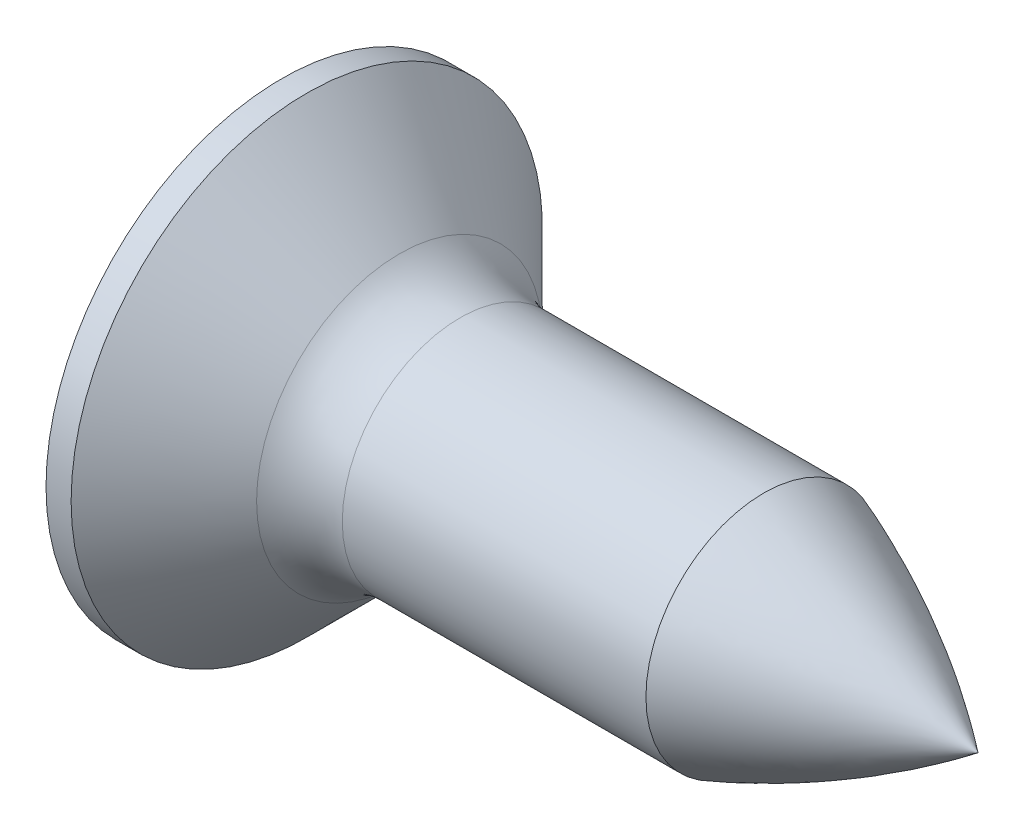
ISO-10303-21;
HEADER;
FILE_DESCRIPTION(('STEP AP214'),'2;1');
FILE_NAME('part.step','',(''),(''),'','','');
FILE_SCHEMA(('AUTOMOTIVE_DESIGN { 1 0 10303 214 1 1 1 1 }'));
ENDSEC;
DATA;
#1=APPLICATION_CONTEXT('core data for automotive mechanical design processes');
#2=APPLICATION_PROTOCOL_DEFINITION('international standard','automotive_design',2000,#1);
#3=PRODUCT_CONTEXT('',#1,'mechanical');
#4=PRODUCT('Part','Part','',(#3));
#5=PRODUCT_RELATED_PRODUCT_CATEGORY('part','',(#4));
#6=PRODUCT_DEFINITION_FORMATION('','',#4);
#7=PRODUCT_DEFINITION_CONTEXT('part definition',#1,'design');
#8=PRODUCT_DEFINITION('design','',#6,#7);
#9=PRODUCT_DEFINITION_SHAPE('','',#8);
#10=(LENGTH_UNIT() NAMED_UNIT(*) SI_UNIT(.MILLI.,.METRE.));
#11=(NAMED_UNIT(*) PLANE_ANGLE_UNIT() SI_UNIT($,.RADIAN.));
#12=(NAMED_UNIT(*) SI_UNIT($,.STERADIAN.) SOLID_ANGLE_UNIT());
#13=UNCERTAINTY_MEASURE_WITH_UNIT(LENGTH_MEASURE(1.E-05),#10,'distance_accuracy_value','');
#14=(GEOMETRIC_REPRESENTATION_CONTEXT(3) GLOBAL_UNCERTAINTY_ASSIGNED_CONTEXT((#13)) GLOBAL_UNIT_ASSIGNED_CONTEXT((#10,
#11,#12)) REPRESENTATION_CONTEXT('',''));
#15=CARTESIAN_POINT('',(0.,0.,0.));
#16=DIRECTION('',(0.,0.,1.));
#17=DIRECTION('',(1.,0.,0.));
#18=AXIS2_PLACEMENT_3D('',#15,#16,#17);
#19=CARTESIAN_POINT('',(-20.4182283145145,0.,0.));
#20=DIRECTION('',(-1.,0.,0.));
#21=DIRECTION('',(0.,0.,1.));
#22=AXIS2_PLACEMENT_3D('',#19,#20,#21);
#23=CYLINDRICAL_SURFACE('',#22,1.09999999999999);
#24=CARTESIAN_POINT('',(2.16568542494922,0.,0.));
#25=DIRECTION('',(-1.,0.,0.));
#26=DIRECTION('',(0.,0.,1.));
#27=AXIS2_PLACEMENT_3D('',#24,#25,#26);
#28=CIRCLE('',#27,1.09999999999999);
#29=CARTESIAN_POINT('',(2.16568542494922,0.,1.09999999999999));
#30=VERTEX_POINT('',#29);
#31=EDGE_CURVE('E171',#30,#30,#28,.T.);
#32=ORIENTED_EDGE('',*,*,#31,.F.);
#33=EDGE_LOOP('',(#32));
#34=FACE_BOUND('',#33,.T.);
#35=CARTESIAN_POINT('',(5.,0.,0.));
#36=DIRECTION('',(1.,0.,0.));
#37=DIRECTION('',(0.,1.,0.));
#38=AXIS2_PLACEMENT_3D('',#35,#36,#37);
#39=CIRCLE('',#38,1.1);
#40=CARTESIAN_POINT('',(5.,1.1,0.));
#41=VERTEX_POINT('',#40);
#42=EDGE_CURVE('E251',#41,#41,#39,.T.);
#43=ORIENTED_EDGE('',*,*,#42,.F.);
#44=EDGE_LOOP('',(#43));
#45=FACE_BOUND('',#44,.T.);
#46=ADVANCED_FACE('F38',(#34,#45),#23,.T.);
#47=CARTESIAN_POINT('',(5.09,0.,0.));
#48=DIRECTION('',(-1.,0.,0.));
#49=DIRECTION('',(0.,1.,0.));
#50=AXIS2_PLACEMENT_3D('',#47,#48,#49);
#51=SPHERICAL_SURFACE('',#50,5.09);
#52=CARTESIAN_POINT('',(0.5,0.,0.));
#53=DIRECTION('',(-1.,0.,0.));
#54=DIRECTION('',(0.,0.,1.));
#55=AXIS2_PLACEMENT_3D('',#52,#53,#54);
#56=CIRCLE('',#55,2.19999999999999);
#57=CARTESIAN_POINT('',(0.5,0.,2.19999999999999));
#58=VERTEX_POINT('',#57);
#59=EDGE_CURVE('E228',#58,#58,#56,.T.);
#60=ORIENTED_EDGE('',*,*,#59,.T.);
#61=EDGE_LOOP('',(#60));
#62=FACE_BOUND('',#61,.T.);
#63=CARTESIAN_POINT('',(5.09,0.,-0.220000000000001));
#64=DIRECTION('',(0.,0.,1.));
#65=DIRECTION('',(1.,0.,0.));
#66=AXIS2_PLACEMENT_3D('',#63,#64,#65);
#67=CIRCLE('',#66,5.08524335700859);
#68=CARTESIAN_POINT('',(0.111345989317939,1.0357143630941,-0.220000000000001));
#69=VERTEX_POINT('',#68);
#70=CARTESIAN_POINT('',(0.00951773942669838,0.219999999999999,-0.220000000000001));
#71=VERTEX_POINT('',#70);
#72=EDGE_CURVE('E11',#69,#71,#67,.T.);
#73=ORIENTED_EDGE('',*,*,#72,.F.);
#74=CARTESIAN_POINT('',(4.29381397208144,-1.3790346526314,0.));
#75=DIRECTION('',(-0.500000000000001,-0.866025403784438,0.));
#76=DIRECTION('',(0.866025403784438,-0.500000000000001,0.));
#77=AXIS2_PLACEMENT_3D('',#74,#75,#76);
#78=CIRCLE('',#77,4.83450630734815);
#79=CARTESIAN_POINT('',(0.111345989317939,1.0357143630941,0.219999999999999));
#80=VERTEX_POINT('',#79);
#81=EDGE_CURVE('E48',#80,#69,#78,.T.);
#82=ORIENTED_EDGE('',*,*,#81,.F.);
#83=CARTESIAN_POINT('',(5.09,0.,0.219999999999999));
#84=DIRECTION('',(0.,0.,-1.));
#85=DIRECTION('',(0.,1.,0.));
#86=AXIS2_PLACEMENT_3D('',#83,#84,#85);
#87=CIRCLE('',#86,5.08524335700859);
#88=CARTESIAN_POINT('',(0.00951773942669838,0.219999999999999,0.219999999999999));
#89=VERTEX_POINT('',#88);
#90=EDGE_CURVE('E167',#89,#80,#87,.T.);
#91=ORIENTED_EDGE('',*,*,#90,.F.);
#92=CARTESIAN_POINT('',(5.09,0.219999999999999,0.));
#93=DIRECTION('',(0.,-1.,0.));
#94=DIRECTION('',(0.,0.,-1.));
#95=AXIS2_PLACEMENT_3D('',#92,#93,#94);
#96=CIRCLE('',#95,5.08524335700859);
#97=CARTESIAN_POINT('',(0.111345989317938,0.219999999999999,1.0357143630941));
#98=VERTEX_POINT('',#97);
#99=EDGE_CURVE('E161',#98,#89,#96,.T.);
#100=ORIENTED_EDGE('',*,*,#99,.F.);
#101=CARTESIAN_POINT('',(4.29381397208144,0.,-1.3790346526314));
#102=DIRECTION('',(-0.500000000000001,0.,-0.866025403784438));
#103=DIRECTION('',(-0.866025403784438,0.,0.500000000000001));
#104=AXIS2_PLACEMENT_3D('',#101,#102,#103);
#105=CIRCLE('',#104,4.83450630734815);
#106=CARTESIAN_POINT('',(0.111345989317938,-0.220000000000001,1.0357143630941));
#107=VERTEX_POINT('',#106);
#108=EDGE_CURVE('E159',#107,#98,#105,.T.);
#109=ORIENTED_EDGE('',*,*,#108,.F.);
#110=CARTESIAN_POINT('',(5.09,-0.220000000000001,0.));
#111=DIRECTION('',(0.,1.,0.));
#112=DIRECTION('',(0.,0.,1.));
#113=AXIS2_PLACEMENT_3D('',#110,#111,#112);
#114=CIRCLE('',#113,5.08524335700859);
#115=CARTESIAN_POINT('',(0.00951773942669838,-0.220000000000001,0.219999999999999));
#116=VERTEX_POINT('',#115);
#117=EDGE_CURVE('E143',#116,#107,#114,.T.);
#118=ORIENTED_EDGE('',*,*,#117,.F.);
#119=CARTESIAN_POINT('',(5.09,0.,0.219999999999999));
#120=DIRECTION('',(0.,0.,-1.));
#121=DIRECTION('',(-1.,0.,0.));
#122=AXIS2_PLACEMENT_3D('',#119,#120,#121);
#123=CIRCLE('',#122,5.08524335700859);
#124=CARTESIAN_POINT('',(0.111345989317937,-1.0357143630941,0.219999999999999));
#125=VERTEX_POINT('',#124);
#126=EDGE_CURVE('E133',#125,#116,#123,.T.);
#127=ORIENTED_EDGE('',*,*,#126,.F.);
#128=CARTESIAN_POINT('',(4.29381397208144,1.3790346526314,0.));
#129=DIRECTION('',(-0.500000000000001,0.866025403784438,0.));
#130=DIRECTION('',(-0.866025403784438,-0.500000000000001,0.));
#131=AXIS2_PLACEMENT_3D('',#128,#129,#130);
#132=CIRCLE('',#131,4.83450630734815);
#133=CARTESIAN_POINT('',(0.111345989317937,-1.0357143630941,-0.220000000000001));
#134=VERTEX_POINT('',#133);
#135=EDGE_CURVE('E144',#134,#125,#132,.T.);
#136=ORIENTED_EDGE('',*,*,#135,.F.);
#137=CARTESIAN_POINT('',(5.09,0.,-0.220000000000001));
#138=DIRECTION('',(0.,0.,1.));
#139=DIRECTION('',(0.,-1.,0.));
#140=AXIS2_PLACEMENT_3D('',#137,#138,#139);
#141=CIRCLE('',#140,5.08524335700859);
#142=CARTESIAN_POINT('',(0.00951773942669838,-0.220000000000001,-0.220000000000001));
#143=VERTEX_POINT('',#142);
#144=EDGE_CURVE('E174',#143,#134,#141,.T.);
#145=ORIENTED_EDGE('',*,*,#144,.F.);
#146=CARTESIAN_POINT('',(5.09,-0.220000000000001,0.));
#147=DIRECTION('',(0.,1.,0.));
#148=DIRECTION('',(0.,0.,1.));
#149=AXIS2_PLACEMENT_3D('',#146,#147,#148);
#150=CIRCLE('',#149,5.08524335700859);
#151=CARTESIAN_POINT('',(0.111345989317939,-0.220000000000001,-1.0357143630941));
#152=VERTEX_POINT('',#151);
#153=EDGE_CURVE('E172',#152,#143,#150,.T.);
#154=ORIENTED_EDGE('',*,*,#153,.F.);
#155=CARTESIAN_POINT('',(4.29381397208144,0.,1.3790346526314));
#156=DIRECTION('',(-0.500000000000001,0.,0.866025403784438));
#157=DIRECTION('',(0.866025403784438,0.,0.500000000000001));
#158=AXIS2_PLACEMENT_3D('',#155,#156,#157);
#159=CIRCLE('',#158,4.83450630734815);
#160=CARTESIAN_POINT('',(0.111345989317939,0.219999999999999,-1.0357143630941));
#161=VERTEX_POINT('',#160);
#162=EDGE_CURVE('E170',#161,#152,#159,.T.);
#163=ORIENTED_EDGE('',*,*,#162,.F.);
#164=CARTESIAN_POINT('',(5.09,0.219999999999999,0.));
#165=DIRECTION('',(0.,-1.,0.));
#166=DIRECTION('',(0.,0.,-1.));
#167=AXIS2_PLACEMENT_3D('',#164,#165,#166);
#168=CIRCLE('',#167,5.08524335700859);
#169=EDGE_CURVE('E168',#71,#161,#168,.T.);
#170=ORIENTED_EDGE('',*,*,#169,.F.);
#171=EDGE_LOOP('',(#73,#82,#91,#100,#109,#118,#127,#136,#145,#154,#163,#170));
#172=FACE_BOUND('',#171,.T.);
#173=ADVANCED_FACE('F157',(#62,#172),#51,.T.);
#174=CARTESIAN_POINT('',(2.16568542494923,0.,0.));
#175=DIRECTION('',(-1.,0.,0.));
#176=DIRECTION('',(0.,0.,1.));
#177=AXIS2_PLACEMENT_3D('',#174,#175,#176);
#178=TOROIDAL_SURFACE('',#177,1.9,0.800000000000003);
#179=CARTESIAN_POINT('',(1.6,0.,0.));
#180=DIRECTION('',(-1.,0.,0.));
#181=DIRECTION('',(0.,0.,1.));
#182=AXIS2_PLACEMENT_3D('',#179,#180,#181);
#183=CIRCLE('',#182,1.33431457505075);
#184=CARTESIAN_POINT('',(1.6,0.,1.33431457505075));
#185=VERTEX_POINT('',#184);
#186=EDGE_CURVE('E195',#185,#185,#183,.T.);
#187=ORIENTED_EDGE('',*,*,#186,.F.);
#188=EDGE_LOOP('',(#187));
#189=FACE_BOUND('',#188,.T.);
#190=ORIENTED_EDGE('',*,*,#31,.T.);
#191=EDGE_LOOP('',(#190));
#192=FACE_BOUND('',#191,.T.);
#193=ADVANCED_FACE('F283',(#189,#192),#178,.F.);
#194=CARTESIAN_POINT('',(-20.4182283145145,0.,0.));
#195=DIRECTION('',(-1.,0.,0.));
#196=DIRECTION('',(0.,0.,1.));
#197=AXIS2_PLACEMENT_3D('',#194,#195,#196);
#198=CYLINDRICAL_SURFACE('',#197,2.19999999999999);
#199=ORIENTED_EDGE('',*,*,#59,.F.);
#200=EDGE_LOOP('',(#199));
#201=FACE_BOUND('',#200,.T.);
#202=CARTESIAN_POINT('',(0.734314575050726,0.,0.));
#203=DIRECTION('',(-1.,0.,0.));
#204=DIRECTION('',(0.,0.,1.));
#205=AXIS2_PLACEMENT_3D('',#202,#203,#204);
#206=CIRCLE('',#205,2.2);
#207=CARTESIAN_POINT('',(0.734314575050726,0.,2.2));
#208=VERTEX_POINT('',#207);
#209=EDGE_CURVE('E224',#208,#208,#206,.T.);
#210=ORIENTED_EDGE('',*,*,#209,.T.);
#211=EDGE_LOOP('',(#210));
#212=FACE_BOUND('',#211,.T.);
#213=ADVANCED_FACE('F291',(#201,#212),#198,.T.);
#214=CARTESIAN_POINT('',(1.6,0.,0.));
#215=DIRECTION('',(-1.,0.,0.));
#216=DIRECTION('',(0.,0.,1.));
#217=AXIS2_PLACEMENT_3D('',#214,#215,#216);
#218=CONICAL_SURFACE('',#217,1.33431457505075,0.785398163397429);
#219=ORIENTED_EDGE('',*,*,#209,.F.);
#220=EDGE_LOOP('',(#219));
#221=FACE_BOUND('',#220,.T.);
#222=ORIENTED_EDGE('',*,*,#186,.T.);
#223=EDGE_LOOP('',(#222));
#224=FACE_BOUND('',#223,.T.);
#225=ADVANCED_FACE('F359',(#221,#224),#218,.T.);
#226=CARTESIAN_POINT('',(1.2,1.1,-0.220000000000001));
#227=DIRECTION('',(0.,0.,1.));
#228=DIRECTION('',(1.,0.,0.));
#229=AXIS2_PLACEMENT_3D('',#226,#227,#228);
#230=PLANE('',#229);
#231=ORIENTED_EDGE('',*,*,#72,.T.);
#232=DIRECTION('',(-1.,0.,0.));
#233=VECTOR('',#232,1.);
#234=CARTESIAN_POINT('',(1.2,0.219999999999999,-0.220000000000001));
#235=LINE('',#234,#233);
#236=CARTESIAN_POINT('',(1.2,0.219999999999999,-0.220000000000001));
#237=VERTEX_POINT('',#236);
#238=EDGE_CURVE('E57',#237,#71,#235,.T.);
#239=ORIENTED_EDGE('',*,*,#238,.F.);
#240=DIRECTION('',(0.,1.,0.));
#241=VECTOR('',#240,1.);
#242=CARTESIAN_POINT('',(1.2,1.1,-0.220000000000001));
#243=LINE('',#242,#241);
#244=CARTESIAN_POINT('',(1.2,0.407179676972447,-0.220000000000001));
#245=VERTEX_POINT('',#244);
#246=EDGE_CURVE('E193',#237,#245,#243,.T.);
#247=ORIENTED_EDGE('',*,*,#246,.T.);
#248=DIRECTION('',(-0.866025403784438,0.500000000000001,0.));
#249=VECTOR('',#248,1.);
#250=CARTESIAN_POINT('',(0.,1.1,-0.220000000000001));
#251=LINE('',#250,#249);
#252=EDGE_CURVE('E188',#245,#69,#251,.T.);
#253=ORIENTED_EDGE('',*,*,#252,.T.);
#254=EDGE_LOOP('',(#231,#239,#247,#253));
#255=FACE_BOUND('',#254,.T.);
#256=ADVANCED_FACE('F246',(#255),#230,.T.);
#257=CARTESIAN_POINT('',(0.,1.1,0.));
#258=DIRECTION('',(-0.500000000000001,-0.866025403784438,0.));
#259=DIRECTION('',(0.866025403784438,-0.500000000000001,0.));
#260=AXIS2_PLACEMENT_3D('',#257,#258,#259);
#261=PLANE('',#260);
#262=ORIENTED_EDGE('',*,*,#81,.T.);
#263=ORIENTED_EDGE('',*,*,#252,.F.);
#264=DIRECTION('',(0.,0.,1.));
#265=VECTOR('',#264,1.);
#266=CARTESIAN_POINT('',(1.2,0.407179676972447,0.));
#267=LINE('',#266,#265);
#268=CARTESIAN_POINT('',(1.2,0.407179676972447,0.219999999999999));
#269=VERTEX_POINT('',#268);
#270=EDGE_CURVE('E190',#245,#269,#267,.T.);
#271=ORIENTED_EDGE('',*,*,#270,.T.);
#272=DIRECTION('',(-0.866025403784438,0.500000000000001,0.));
#273=VECTOR('',#272,1.);
#274=CARTESIAN_POINT('',(0.899999999999999,0.580384757729336,0.219999999999999));
#275=LINE('',#274,#273);
#276=EDGE_CURVE('E185',#269,#80,#275,.T.);
#277=ORIENTED_EDGE('',*,*,#276,.T.);
#278=EDGE_LOOP('',(#262,#263,#271,#277));
#279=FACE_BOUND('',#278,.T.);
#280=ADVANCED_FACE('F40',(#279),#261,.T.);
#281=CARTESIAN_POINT('',(1.2,1.1,0.219999999999999));
#282=DIRECTION('',(0.,0.,-1.));
#283=DIRECTION('',(0.,1.,0.));
#284=AXIS2_PLACEMENT_3D('',#281,#282,#283);
#285=PLANE('',#284);
#286=ORIENTED_EDGE('',*,*,#90,.T.);
#287=ORIENTED_EDGE('',*,*,#276,.F.);
#288=DIRECTION('',(0.,-1.,0.));
#289=VECTOR('',#288,1.);
#290=CARTESIAN_POINT('',(1.2,1.1,0.219999999999999));
#291=LINE('',#290,#289);
#292=CARTESIAN_POINT('',(1.2,0.219999999999999,0.219999999999999));
#293=VERTEX_POINT('',#292);
#294=EDGE_CURVE('E192',#269,#293,#291,.T.);
#295=ORIENTED_EDGE('',*,*,#294,.T.);
#296=DIRECTION('',(-1.,0.,0.));
#297=VECTOR('',#296,1.);
#298=CARTESIAN_POINT('',(1.2,0.219999999999999,0.219999999999999));
#299=LINE('',#298,#297);
#300=EDGE_CURVE('E189',#293,#89,#299,.T.);
#301=ORIENTED_EDGE('',*,*,#300,.T.);
#302=EDGE_LOOP('',(#286,#287,#295,#301));
#303=FACE_BOUND('',#302,.T.);
#304=ADVANCED_FACE('F236',(#303),#285,.T.);
#305=CARTESIAN_POINT('',(1.2,0.219999999999999,0.219999999999999));
#306=DIRECTION('',(0.,-1.,0.));
#307=DIRECTION('',(0.,0.,-1.));
#308=AXIS2_PLACEMENT_3D('',#305,#306,#307);
#309=PLANE('',#308);
#310=ORIENTED_EDGE('',*,*,#99,.T.);
#311=ORIENTED_EDGE('',*,*,#300,.F.);
#312=DIRECTION('',(0.,0.,1.));
#313=VECTOR('',#312,1.);
#314=CARTESIAN_POINT('',(1.2,0.219999999999999,0.219999999999999));
#315=LINE('',#314,#313);
#316=CARTESIAN_POINT('',(1.2,0.219999999999999,0.407179676972447));
#317=VERTEX_POINT('',#316);
#318=EDGE_CURVE('E201',#293,#317,#315,.T.);
#319=ORIENTED_EDGE('',*,*,#318,.T.);
#320=DIRECTION('',(-0.866025403784438,0.,0.500000000000001));
#321=VECTOR('',#320,1.);
#322=CARTESIAN_POINT('',(0.,0.219999999999999,1.1));
#323=LINE('',#322,#321);
#324=EDGE_CURVE('E198',#317,#98,#323,.T.);
#325=ORIENTED_EDGE('',*,*,#324,.T.);
#326=EDGE_LOOP('',(#310,#311,#319,#325));
#327=FACE_BOUND('',#326,.T.);
#328=ADVANCED_FACE('F297',(#327),#309,.T.);
#329=CARTESIAN_POINT('',(0.,0.,1.1));
#330=DIRECTION('',(-0.500000000000001,0.,-0.866025403784438));
#331=DIRECTION('',(-0.866025403784438,0.,0.500000000000001));
#332=AXIS2_PLACEMENT_3D('',#329,#330,#331);
#333=PLANE('',#332);
#334=ORIENTED_EDGE('',*,*,#108,.T.);
#335=ORIENTED_EDGE('',*,*,#324,.F.);
#336=DIRECTION('',(0.,-1.,0.));
#337=VECTOR('',#336,1.);
#338=CARTESIAN_POINT('',(1.2,0.,0.407179676972447));
#339=LINE('',#338,#337);
#340=CARTESIAN_POINT('',(1.2,-0.220000000000001,0.407179676972447));
#341=VERTEX_POINT('',#340);
#342=EDGE_CURVE('E199',#317,#341,#339,.T.);
#343=ORIENTED_EDGE('',*,*,#342,.T.);
#344=DIRECTION('',(-0.866025403784438,0.,0.500000000000001));
#345=VECTOR('',#344,1.);
#346=CARTESIAN_POINT('',(1.28105117766515,-0.220000000000001,0.360384757729335));
#347=LINE('',#346,#345);
#348=EDGE_CURVE('E153',#341,#107,#347,.T.);
#349=ORIENTED_EDGE('',*,*,#348,.T.);
#350=EDGE_LOOP('',(#334,#335,#343,#349));
#351=FACE_BOUND('',#350,.T.);
#352=ADVANCED_FACE('F295',(#351),#333,.T.);
#353=CARTESIAN_POINT('',(1.2,-0.220000000000001,0.219999999999999));
#354=DIRECTION('',(0.,1.,0.));
#355=DIRECTION('',(0.,0.,1.));
#356=AXIS2_PLACEMENT_3D('',#353,#354,#355);
#357=PLANE('',#356);
#358=ORIENTED_EDGE('',*,*,#117,.T.);
#359=ORIENTED_EDGE('',*,*,#348,.F.);
#360=DIRECTION('',(0.,0.,-1.));
#361=VECTOR('',#360,1.);
#362=CARTESIAN_POINT('',(1.2,-0.220000000000001,0.219999999999999));
#363=LINE('',#362,#361);
#364=CARTESIAN_POINT('',(1.2,-0.220000000000001,0.219999999999999));
#365=VERTEX_POINT('',#364);
#366=EDGE_CURVE('E152',#341,#365,#363,.T.);
#367=ORIENTED_EDGE('',*,*,#366,.T.);
#368=DIRECTION('',(-1.,0.,0.));
#369=VECTOR('',#368,1.);
#370=CARTESIAN_POINT('',(1.2,-0.220000000000001,0.219999999999999));
#371=LINE('',#370,#369);
#372=EDGE_CURVE('E136',#365,#116,#371,.T.);
#373=ORIENTED_EDGE('',*,*,#372,.T.);
#374=EDGE_LOOP('',(#358,#359,#367,#373));
#375=FACE_BOUND('',#374,.T.);
#376=ADVANCED_FACE('F148',(#375),#357,.T.);
#377=CARTESIAN_POINT('',(1.2,-1.1,0.219999999999999));
#378=DIRECTION('',(0.,0.,-1.));
#379=DIRECTION('',(-1.,0.,0.));
#380=AXIS2_PLACEMENT_3D('',#377,#378,#379);
#381=PLANE('',#380);
#382=ORIENTED_EDGE('',*,*,#126,.T.);
#383=ORIENTED_EDGE('',*,*,#372,.F.);
#384=DIRECTION('',(0.,-1.,0.));
#385=VECTOR('',#384,1.);
#386=CARTESIAN_POINT('',(1.2,-1.1,0.219999999999999));
#387=LINE('',#386,#385);
#388=CARTESIAN_POINT('',(1.2,-0.407179676972448,0.219999999999999));
#389=VERTEX_POINT('',#388);
#390=EDGE_CURVE('E182',#365,#389,#387,.T.);
#391=ORIENTED_EDGE('',*,*,#390,.T.);
#392=DIRECTION('',(-0.866025403784438,-0.500000000000001,0.));
#393=VECTOR('',#392,1.);
#394=CARTESIAN_POINT('',(0.,-1.1,0.219999999999999));
#395=LINE('',#394,#393);
#396=EDGE_CURVE('E139',#389,#125,#395,.T.);
#397=ORIENTED_EDGE('',*,*,#396,.T.);
#398=EDGE_LOOP('',(#382,#383,#391,#397));
#399=FACE_BOUND('',#398,.T.);
#400=ADVANCED_FACE('F135',(#399),#381,.T.);
#401=CARTESIAN_POINT('',(0.,-1.1,0.));
#402=DIRECTION('',(-0.500000000000001,0.866025403784438,0.));
#403=DIRECTION('',(-0.866025403784438,-0.500000000000001,0.));
#404=AXIS2_PLACEMENT_3D('',#401,#402,#403);
#405=PLANE('',#404);
#406=ORIENTED_EDGE('',*,*,#135,.T.);
#407=ORIENTED_EDGE('',*,*,#396,.F.);
#408=DIRECTION('',(0.,0.,-1.));
#409=VECTOR('',#408,1.);
#410=CARTESIAN_POINT('',(1.2,-0.407179676972448,0.));
#411=LINE('',#410,#409);
#412=CARTESIAN_POINT('',(1.2,-0.407179676972449,-0.220000000000001));
#413=VERTEX_POINT('',#412);
#414=EDGE_CURVE('E180',#389,#413,#411,.T.);
#415=ORIENTED_EDGE('',*,*,#414,.T.);
#416=DIRECTION('',(-0.866025403784438,-0.500000000000001,0.));
#417=VECTOR('',#416,1.);
#418=CARTESIAN_POINT('',(0.899999999999999,-0.580384757729337,-0.220000000000001));
#419=LINE('',#418,#417);
#420=EDGE_CURVE('E176',#413,#134,#419,.T.);
#421=ORIENTED_EDGE('',*,*,#420,.T.);
#422=EDGE_LOOP('',(#406,#407,#415,#421));
#423=FACE_BOUND('',#422,.T.);
#424=ADVANCED_FACE('F260',(#423),#405,.T.);
#425=CARTESIAN_POINT('',(1.2,-1.1,-0.220000000000001));
#426=DIRECTION('',(0.,0.,1.));
#427=DIRECTION('',(0.,-1.,0.));
#428=AXIS2_PLACEMENT_3D('',#425,#426,#427);
#429=PLANE('',#428);
#430=ORIENTED_EDGE('',*,*,#144,.T.);
#431=ORIENTED_EDGE('',*,*,#420,.F.);
#432=DIRECTION('',(0.,1.,0.));
#433=VECTOR('',#432,1.);
#434=CARTESIAN_POINT('',(1.2,-1.1,-0.220000000000001));
#435=LINE('',#434,#433);
#436=CARTESIAN_POINT('',(1.2,-0.220000000000001,-0.220000000000001));
#437=VERTEX_POINT('',#436);
#438=EDGE_CURVE('E122',#413,#437,#435,.T.);
#439=ORIENTED_EDGE('',*,*,#438,.T.);
#440=DIRECTION('',(-1.,0.,0.));
#441=VECTOR('',#440,1.);
#442=CARTESIAN_POINT('',(1.2,-0.220000000000001,-0.220000000000001));
#443=LINE('',#442,#441);
#444=EDGE_CURVE('E179',#437,#143,#443,.T.);
#445=ORIENTED_EDGE('',*,*,#444,.T.);
#446=EDGE_LOOP('',(#430,#431,#439,#445));
#447=FACE_BOUND('',#446,.T.);
#448=ADVANCED_FACE('F267',(#447),#429,.T.);
#449=CARTESIAN_POINT('',(1.2,-0.220000000000001,-0.220000000000001));
#450=DIRECTION('',(0.,1.,0.));
#451=DIRECTION('',(0.,0.,1.));
#452=AXIS2_PLACEMENT_3D('',#449,#450,#451);
#453=PLANE('',#452);
#454=ORIENTED_EDGE('',*,*,#153,.T.);
#455=ORIENTED_EDGE('',*,*,#444,.F.);
#456=DIRECTION('',(0.,0.,-1.));
#457=VECTOR('',#456,1.);
#458=CARTESIAN_POINT('',(1.2,-0.220000000000001,-0.220000000000001));
#459=LINE('',#458,#457);
#460=CARTESIAN_POINT('',(1.2,-0.220000000000001,-0.407179676972449));
#461=VERTEX_POINT('',#460);
#462=EDGE_CURVE('E114',#437,#461,#459,.T.);
#463=ORIENTED_EDGE('',*,*,#462,.T.);
#464=DIRECTION('',(-0.866025403784438,0.,-0.500000000000001));
#465=VECTOR('',#464,1.);
#466=CARTESIAN_POINT('',(0.,-0.220000000000001,-1.1));
#467=LINE('',#466,#465);
#468=EDGE_CURVE('E42',#461,#152,#467,.T.);
#469=ORIENTED_EDGE('',*,*,#468,.T.);
#470=EDGE_LOOP('',(#454,#455,#463,#469));
#471=FACE_BOUND('',#470,.T.);
#472=ADVANCED_FACE('F266',(#471),#453,.T.);
#473=CARTESIAN_POINT('',(0.,0.,-1.1));
#474=DIRECTION('',(-0.500000000000001,0.,0.866025403784438));
#475=DIRECTION('',(0.866025403784438,0.,0.500000000000001));
#476=AXIS2_PLACEMENT_3D('',#473,#474,#475);
#477=PLANE('',#476);
#478=ORIENTED_EDGE('',*,*,#162,.T.);
#479=ORIENTED_EDGE('',*,*,#468,.F.);
#480=DIRECTION('',(0.,1.,0.));
#481=VECTOR('',#480,1.);
#482=CARTESIAN_POINT('',(1.2,0.,-0.407179676972448));
#483=LINE('',#482,#481);
#484=CARTESIAN_POINT('',(1.2,0.219999999999999,-0.407179676972449));
#485=VERTEX_POINT('',#484);
#486=EDGE_CURVE('E208',#461,#485,#483,.T.);
#487=ORIENTED_EDGE('',*,*,#486,.T.);
#488=DIRECTION('',(-0.866025403784438,0.,-0.500000000000001));
#489=VECTOR('',#488,1.);
#490=CARTESIAN_POINT('',(1.28105117766515,0.219999999999999,-0.360384757729336));
#491=LINE('',#490,#489);
#492=EDGE_CURVE('E206',#485,#161,#491,.T.);
#493=ORIENTED_EDGE('',*,*,#492,.T.);
#494=EDGE_LOOP('',(#478,#479,#487,#493));
#495=FACE_BOUND('',#494,.T.);
#496=ADVANCED_FACE('F263',(#495),#477,.T.);
#497=CARTESIAN_POINT('',(1.2,0.219999999999999,-0.220000000000001));
#498=DIRECTION('',(0.,-1.,0.));
#499=DIRECTION('',(0.,0.,-1.));
#500=AXIS2_PLACEMENT_3D('',#497,#498,#499);
#501=PLANE('',#500);
#502=ORIENTED_EDGE('',*,*,#169,.T.);
#503=ORIENTED_EDGE('',*,*,#492,.F.);
#504=DIRECTION('',(0.,0.,1.));
#505=VECTOR('',#504,1.);
#506=CARTESIAN_POINT('',(1.2,0.219999999999999,-0.220000000000001));
#507=LINE('',#506,#505);
#508=EDGE_CURVE('E209',#485,#237,#507,.T.);
#509=ORIENTED_EDGE('',*,*,#508,.T.);
#510=ORIENTED_EDGE('',*,*,#238,.T.);
#511=EDGE_LOOP('',(#502,#503,#509,#510));
#512=FACE_BOUND('',#511,.T.);
#513=ADVANCED_FACE('F262',(#512),#501,.T.);
#514=CARTESIAN_POINT('',(1.2,-0.220000000000001,-0.220000000000001));
#515=DIRECTION('',(1.,0.,0.));
#516=DIRECTION('',(0.,0.,-1.));
#517=AXIS2_PLACEMENT_3D('',#514,#515,#516);
#518=PLANE('',#517);
#519=ORIENTED_EDGE('',*,*,#246,.F.);
#520=ORIENTED_EDGE('',*,*,#508,.F.);
#521=ORIENTED_EDGE('',*,*,#486,.F.);
#522=ORIENTED_EDGE('',*,*,#462,.F.);
#523=ORIENTED_EDGE('',*,*,#438,.F.);
#524=ORIENTED_EDGE('',*,*,#414,.F.);
#525=ORIENTED_EDGE('',*,*,#390,.F.);
#526=ORIENTED_EDGE('',*,*,#366,.F.);
#527=ORIENTED_EDGE('',*,*,#342,.F.);
#528=ORIENTED_EDGE('',*,*,#318,.F.);
#529=ORIENTED_EDGE('',*,*,#294,.F.);
#530=ORIENTED_EDGE('',*,*,#270,.F.);
#531=EDGE_LOOP('',(#519,#520,#521,#522,#523,#524,#525,#526,#527,#528,#529,#530));
#532=FACE_BOUND('',#531,.T.);
#533=ADVANCED_FACE('F261',(#532),#518,.F.);
#534=CARTESIAN_POINT('',(2.18408286142829,-6.38803116103947,0.));
#535=DIRECTION('',(0.,0.,-1.));
#536=DIRECTION('',(0.,1.,0.));
#537=AXIS2_PLACEMENT_3D('',#534,#535,#536);
#538=CIRCLE('',#537,8.);
#539=TRIMMED_CURVE('',#538,(PARAMETER_VALUE(-0.645990488143612)),
(PARAMETER_VALUE(0.645990488143612)),.T.,.PARAMETER.);
#540=CARTESIAN_POINT('',(2.18408286142829,0.,0.));
#541=DIRECTION('',(1.,0.,0.));
#542=AXIS1_PLACEMENT('',#540,#541);
#543=SURFACE_OF_REVOLUTION('',#539,#542);
#544=ORIENTED_EDGE('',*,*,#42,.T.);
#545=EDGE_LOOP('',(#544));
#546=FACE_BOUND('',#545,.T.);
#547=CARTESIAN_POINT('',(7.,0.,0.));
#548=VERTEX_POINT('',#547);
#549=VERTEX_LOOP('',#548);
#550=FACE_BOUND('',#549,.T.);
#551=ADVANCED_FACE('F312',(#546,#550),#543,.T.);
#552=CLOSED_SHELL('',(#46,#173,#193,#213,#225,#256,#280,#304,#328,#352,#376,#400,#424,#448,#472,
#496,#513,#533,#551));
#553=MANIFOLD_SOLID_BREP('B2',#552);
#554=ADVANCED_BREP_SHAPE_REPRESENTATION('',(#18,#553),#14);
#555=SHAPE_DEFINITION_REPRESENTATION(#9,#554);
ENDSEC;
END-ISO-10303-21;
